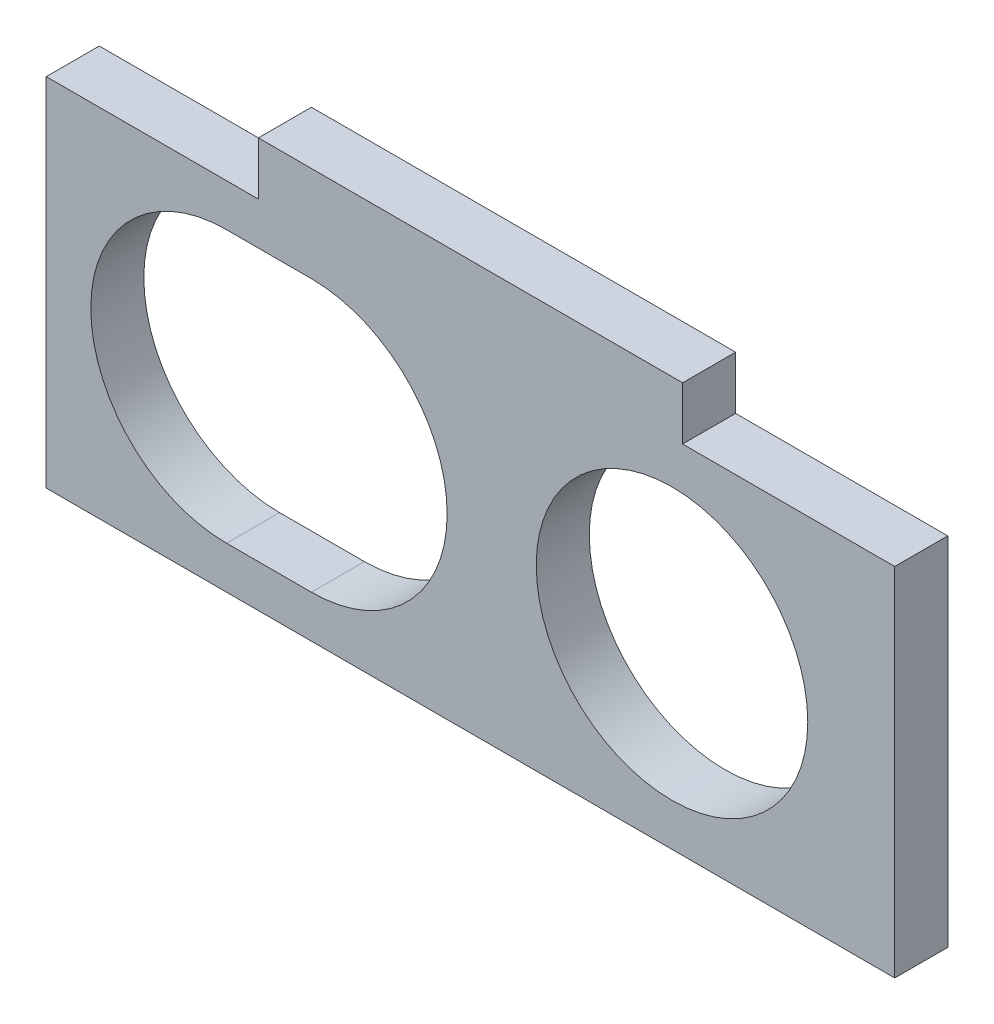
ISO-10303-21;
HEADER;
FILE_DESCRIPTION(('STEP AP214'),'2;1');
FILE_NAME('part.step','',(''),(''),'','','');
FILE_SCHEMA(('AUTOMOTIVE_DESIGN { 1 0 10303 214 1 1 1 1 }'));
ENDSEC;
DATA;
#1=APPLICATION_CONTEXT('core data for automotive mechanical design processes');
#2=APPLICATION_PROTOCOL_DEFINITION('international standard','automotive_design',2000,#1);
#3=PRODUCT_CONTEXT('',#1,'mechanical');
#4=PRODUCT('Part','Part','',(#3));
#5=PRODUCT_RELATED_PRODUCT_CATEGORY('part','',(#4));
#6=PRODUCT_DEFINITION_FORMATION('','',#4);
#7=PRODUCT_DEFINITION_CONTEXT('part definition',#1,'design');
#8=PRODUCT_DEFINITION('design','',#6,#7);
#9=PRODUCT_DEFINITION_SHAPE('','',#8);
#10=(LENGTH_UNIT() NAMED_UNIT(*) SI_UNIT(.MILLI.,.METRE.));
#11=(NAMED_UNIT(*) PLANE_ANGLE_UNIT() SI_UNIT($,.RADIAN.));
#12=(NAMED_UNIT(*) SI_UNIT($,.STERADIAN.) SOLID_ANGLE_UNIT());
#13=UNCERTAINTY_MEASURE_WITH_UNIT(LENGTH_MEASURE(1.E-05),#10,'distance_accuracy_value','');
#14=(GEOMETRIC_REPRESENTATION_CONTEXT(3) GLOBAL_UNCERTAINTY_ASSIGNED_CONTEXT((#13)) GLOBAL_UNIT_ASSIGNED_CONTEXT((#10,
#11,#12)) REPRESENTATION_CONTEXT('',''));
#15=CARTESIAN_POINT('',(0.,0.,0.));
#16=DIRECTION('',(0.,0.,1.));
#17=DIRECTION('',(1.,0.,0.));
#18=AXIS2_PLACEMENT_3D('',#15,#16,#17);
#19=CARTESIAN_POINT('',(25.4,-12.2555,3.175));
#20=DIRECTION('',(-1.,0.,0.));
#21=DIRECTION('',(0.,0.,1.));
#22=AXIS2_PLACEMENT_3D('',#19,#20,#21);
#23=PLANE('',#22);
#24=DIRECTION('',(0.,1.,0.));
#25=VECTOR('',#24,1.);
#26=CARTESIAN_POINT('',(25.4,-12.2555,0.));
#27=LINE('',#26,#25);
#28=CARTESIAN_POINT('',(25.4,-12.2555,0.));
#29=VERTEX_POINT('',#28);
#30=CARTESIAN_POINT('',(25.4,9.08050000000002,0.));
#31=VERTEX_POINT('',#30);
#32=EDGE_CURVE('E145',#29,#31,#27,.T.);
#33=ORIENTED_EDGE('',*,*,#32,.T.);
#34=DIRECTION('',(0.,0.,1.));
#35=VECTOR('',#34,1.);
#36=CARTESIAN_POINT('',(25.4,9.08050000000002,0.));
#37=LINE('',#36,#35);
#38=CARTESIAN_POINT('',(25.4,9.08050000000002,3.175));
#39=VERTEX_POINT('',#38);
#40=EDGE_CURVE('E181',#31,#39,#37,.T.);
#41=ORIENTED_EDGE('',*,*,#40,.T.);
#42=DIRECTION('',(0.,1.,0.));
#43=VECTOR('',#42,1.);
#44=CARTESIAN_POINT('',(25.4,-12.2555,3.175));
#45=LINE('',#44,#43);
#46=CARTESIAN_POINT('',(25.4,-12.2555,3.175));
#47=VERTEX_POINT('',#46);
#48=EDGE_CURVE('E154',#47,#39,#45,.T.);
#49=ORIENTED_EDGE('',*,*,#48,.F.);
#50=DIRECTION('',(0.,0.,-1.));
#51=VECTOR('',#50,1.);
#52=CARTESIAN_POINT('',(25.4,-12.2555,3.175));
#53=LINE('',#52,#51);
#54=EDGE_CURVE('E40',#47,#29,#53,.T.);
#55=ORIENTED_EDGE('',*,*,#54,.T.);
#56=EDGE_LOOP('',(#33,#41,#49,#55));
#57=FACE_BOUND('',#56,.T.);
#58=ADVANCED_FACE('F33',(#57),#23,.F.);
#59=CARTESIAN_POINT('',(-25.4,12.2555,3.175));
#60=DIRECTION('',(0.,-1.,0.));
#61=DIRECTION('',(0.,0.,-1.));
#62=AXIS2_PLACEMENT_3D('',#59,#60,#61);
#63=PLANE('',#62);
#64=DIRECTION('',(-1.,0.,0.));
#65=VECTOR('',#64,1.);
#66=CARTESIAN_POINT('',(-25.4,12.2555,3.175));
#67=LINE('',#66,#65);
#68=CARTESIAN_POINT('',(12.7,12.2555,3.175));
#69=VERTEX_POINT('',#68);
#70=CARTESIAN_POINT('',(-12.7,12.2555,3.175));
#71=VERTEX_POINT('',#70);
#72=EDGE_CURVE('E137',#69,#71,#67,.T.);
#73=ORIENTED_EDGE('',*,*,#72,.F.);
#74=DIRECTION('',(0.,0.,1.));
#75=VECTOR('',#74,1.);
#76=CARTESIAN_POINT('',(12.7,12.2555,0.));
#77=LINE('',#76,#75);
#78=CARTESIAN_POINT('',(12.7,12.2555,0.));
#79=VERTEX_POINT('',#78);
#80=EDGE_CURVE('E124',#79,#69,#77,.T.);
#81=ORIENTED_EDGE('',*,*,#80,.F.);
#82=DIRECTION('',(-1.,0.,0.));
#83=VECTOR('',#82,1.);
#84=CARTESIAN_POINT('',(-25.4,12.2555,0.));
#85=LINE('',#84,#83);
#86=CARTESIAN_POINT('',(-12.7,12.2555,0.));
#87=VERTEX_POINT('',#86);
#88=EDGE_CURVE('E135',#79,#87,#85,.T.);
#89=ORIENTED_EDGE('',*,*,#88,.T.);
#90=DIRECTION('',(0.,0.,1.));
#91=VECTOR('',#90,1.);
#92=CARTESIAN_POINT('',(-12.7,12.2555,0.));
#93=LINE('',#92,#91);
#94=EDGE_CURVE('E150',#87,#71,#93,.T.);
#95=ORIENTED_EDGE('',*,*,#94,.T.);
#96=EDGE_LOOP('',(#73,#81,#89,#95));
#97=FACE_BOUND('',#96,.T.);
#98=ADVANCED_FACE('F133',(#97),#63,.F.);
#99=CARTESIAN_POINT('',(-25.4,-12.2555,3.175));
#100=DIRECTION('',(1.,0.,0.));
#101=DIRECTION('',(0.,0.,-1.));
#102=AXIS2_PLACEMENT_3D('',#99,#100,#101);
#103=PLANE('',#102);
#104=DIRECTION('',(0.,-1.,0.));
#105=VECTOR('',#104,1.);
#106=CARTESIAN_POINT('',(-25.4,-12.2555,3.175));
#107=LINE('',#106,#105);
#108=CARTESIAN_POINT('',(-25.4,9.0805,3.175));
#109=VERTEX_POINT('',#108);
#110=CARTESIAN_POINT('',(-25.4,-12.2555,3.175));
#111=VERTEX_POINT('',#110);
#112=EDGE_CURVE('E161',#109,#111,#107,.T.);
#113=ORIENTED_EDGE('',*,*,#112,.F.);
#114=DIRECTION('',(0.,0.,1.));
#115=VECTOR('',#114,1.);
#116=CARTESIAN_POINT('',(-25.4,9.0805,0.));
#117=LINE('',#116,#115);
#118=CARTESIAN_POINT('',(-25.4,9.0805,0.));
#119=VERTEX_POINT('',#118);
#120=EDGE_CURVE('E169',#119,#109,#117,.T.);
#121=ORIENTED_EDGE('',*,*,#120,.F.);
#122=DIRECTION('',(0.,-1.,0.));
#123=VECTOR('',#122,1.);
#124=CARTESIAN_POINT('',(-25.4,-12.2555,0.));
#125=LINE('',#124,#123);
#126=CARTESIAN_POINT('',(-25.4,-12.2555,0.));
#127=VERTEX_POINT('',#126);
#128=EDGE_CURVE('E144',#119,#127,#125,.T.);
#129=ORIENTED_EDGE('',*,*,#128,.T.);
#130=DIRECTION('',(0.,0.,-1.));
#131=VECTOR('',#130,1.);
#132=CARTESIAN_POINT('',(-25.4,-12.2555,3.175));
#133=LINE('',#132,#131);
#134=EDGE_CURVE('E11',#111,#127,#133,.T.);
#135=ORIENTED_EDGE('',*,*,#134,.F.);
#136=EDGE_LOOP('',(#113,#121,#129,#135));
#137=FACE_BOUND('',#136,.T.);
#138=ADVANCED_FACE('F245',(#137),#103,.F.);
#139=CARTESIAN_POINT('',(-25.4,-12.2555,3.175));
#140=DIRECTION('',(0.,1.,0.));
#141=DIRECTION('',(0.,0.,1.));
#142=AXIS2_PLACEMENT_3D('',#139,#140,#141);
#143=PLANE('',#142);
#144=DIRECTION('',(1.,0.,0.));
#145=VECTOR('',#144,1.);
#146=CARTESIAN_POINT('',(-25.4,-12.2555,0.));
#147=LINE('',#146,#145);
#148=EDGE_CURVE('E147',#127,#29,#147,.T.);
#149=ORIENTED_EDGE('',*,*,#148,.T.);
#150=ORIENTED_EDGE('',*,*,#54,.F.);
#151=DIRECTION('',(1.,0.,0.));
#152=VECTOR('',#151,1.);
#153=CARTESIAN_POINT('',(-25.4,-12.2555,3.175));
#154=LINE('',#153,#152);
#155=EDGE_CURVE('E156',#111,#47,#154,.T.);
#156=ORIENTED_EDGE('',*,*,#155,.F.);
#157=ORIENTED_EDGE('',*,*,#134,.T.);
#158=EDGE_LOOP('',(#149,#150,#156,#157));
#159=FACE_BOUND('',#158,.T.);
#160=ADVANCED_FACE('F249',(#159),#143,.F.);
#161=CARTESIAN_POINT('',(0.,0.,3.175));
#162=DIRECTION('',(0.,0.,-1.));
#163=DIRECTION('',(-1.,0.,0.));
#164=AXIS2_PLACEMENT_3D('',#161,#162,#163);
#165=PLANE('',#164);
#166=DIRECTION('',(1.,0.,0.));
#167=VECTOR('',#166,1.);
#168=CARTESIAN_POINT('',(-14.605,-9.7155,3.175));
#169=LINE('',#168,#167);
#170=CARTESIAN_POINT('',(-14.605,-9.7155,3.175));
#171=VERTEX_POINT('',#170);
#172=CARTESIAN_POINT('',(-9.52499999999999,-9.7155,3.175));
#173=VERTEX_POINT('',#172);
#174=EDGE_CURVE('E207',#171,#173,#169,.T.);
#175=ORIENTED_EDGE('',*,*,#174,.F.);
#176=CARTESIAN_POINT('',(-14.605,-1.58749999999999,3.175));
#177=DIRECTION('',(0.,0.,1.));
#178=DIRECTION('',(1.,0.,0.));
#179=AXIS2_PLACEMENT_3D('',#176,#177,#178);
#180=CIRCLE('',#179,8.12800000000001);
#181=CARTESIAN_POINT('',(-14.605,6.54050000000001,3.175));
#182=VERTEX_POINT('',#181);
#183=EDGE_CURVE('E47',#182,#171,#180,.T.);
#184=ORIENTED_EDGE('',*,*,#183,.F.);
#185=DIRECTION('',(-1.,0.,0.));
#186=VECTOR('',#185,1.);
#187=CARTESIAN_POINT('',(-14.605,6.54050000000001,3.175));
#188=LINE('',#187,#186);
#189=CARTESIAN_POINT('',(-9.52499999999999,6.54050000000001,3.175));
#190=VERTEX_POINT('',#189);
#191=EDGE_CURVE('E200',#190,#182,#188,.T.);
#192=ORIENTED_EDGE('',*,*,#191,.F.);
#193=CARTESIAN_POINT('',(-9.52499999999999,-1.58749999999999,3.175));
#194=DIRECTION('',(0.,0.,1.));
#195=DIRECTION('',(-1.,0.,0.));
#196=AXIS2_PLACEMENT_3D('',#193,#194,#195);
#197=CIRCLE('',#196,8.12800000000001);
#198=EDGE_CURVE('E204',#173,#190,#197,.T.);
#199=ORIENTED_EDGE('',*,*,#198,.F.);
#200=EDGE_LOOP('',(#175,#184,#192,#199));
#201=FACE_BOUND('',#200,.T.);
#202=CARTESIAN_POINT('',(12.065,-1.58749999999999,3.175));
#203=DIRECTION('',(0.,0.,1.));
#204=DIRECTION('',(1.,0.,0.));
#205=AXIS2_PLACEMENT_3D('',#202,#203,#204);
#206=CIRCLE('',#205,8.12799999999999);
#207=CARTESIAN_POINT('',(20.193,-1.58749999999999,3.175));
#208=VERTEX_POINT('',#207);
#209=EDGE_CURVE('E184',#208,#208,#206,.T.);
#210=ORIENTED_EDGE('',*,*,#209,.F.);
#211=EDGE_LOOP('',(#210));
#212=FACE_BOUND('',#211,.T.);
#213=ORIENTED_EDGE('',*,*,#48,.T.);
#214=DIRECTION('',(1.,0.,0.));
#215=VECTOR('',#214,1.);
#216=CARTESIAN_POINT('',(25.4,9.08050000000002,3.175));
#217=LINE('',#216,#215);
#218=CARTESIAN_POINT('',(12.7,9.0805,3.175));
#219=VERTEX_POINT('',#218);
#220=EDGE_CURVE('E129',#219,#39,#217,.T.);
#221=ORIENTED_EDGE('',*,*,#220,.F.);
#222=DIRECTION('',(0.,-1.,0.));
#223=VECTOR('',#222,1.);
#224=CARTESIAN_POINT('',(12.7,12.2555,3.175));
#225=LINE('',#224,#223);
#226=EDGE_CURVE('E199',#69,#219,#225,.T.);
#227=ORIENTED_EDGE('',*,*,#226,.F.);
#228=ORIENTED_EDGE('',*,*,#72,.T.);
#229=DIRECTION('',(0.,1.,0.));
#230=VECTOR('',#229,1.);
#231=CARTESIAN_POINT('',(-12.7,12.2555,3.175));
#232=LINE('',#231,#230);
#233=CARTESIAN_POINT('',(-12.7,9.0805,3.175));
#234=VERTEX_POINT('',#233);
#235=EDGE_CURVE('E174',#234,#71,#232,.T.);
#236=ORIENTED_EDGE('',*,*,#235,.F.);
#237=DIRECTION('',(1.,0.,0.));
#238=VECTOR('',#237,1.);
#239=CARTESIAN_POINT('',(-25.4,9.0805,3.175));
#240=LINE('',#239,#238);
#241=EDGE_CURVE('E178',#109,#234,#240,.T.);
#242=ORIENTED_EDGE('',*,*,#241,.F.);
#243=ORIENTED_EDGE('',*,*,#112,.T.);
#244=ORIENTED_EDGE('',*,*,#155,.T.);
#245=EDGE_LOOP('',(#213,#221,#227,#228,#236,#242,#243,#244));
#246=FACE_BOUND('',#245,.T.);
#247=ADVANCED_FACE('F228',(#201,#212,#246),#165,.F.);
#248=CARTESIAN_POINT('',(0.,0.,0.));
#249=DIRECTION('',(0.,0.,-1.));
#250=DIRECTION('',(-1.,0.,0.));
#251=AXIS2_PLACEMENT_3D('',#248,#249,#250);
#252=PLANE('',#251);
#253=DIRECTION('',(1.,0.,0.));
#254=VECTOR('',#253,1.);
#255=CARTESIAN_POINT('',(25.4,9.08050000000002,0.));
#256=LINE('',#255,#254);
#257=CARTESIAN_POINT('',(12.7,9.0805,0.));
#258=VERTEX_POINT('',#257);
#259=EDGE_CURVE('E55',#258,#31,#256,.T.);
#260=ORIENTED_EDGE('',*,*,#259,.T.);
#261=ORIENTED_EDGE('',*,*,#32,.F.);
#262=ORIENTED_EDGE('',*,*,#148,.F.);
#263=ORIENTED_EDGE('',*,*,#128,.F.);
#264=DIRECTION('',(1.,0.,0.));
#265=VECTOR('',#264,1.);
#266=CARTESIAN_POINT('',(-25.4,9.0805,0.));
#267=LINE('',#266,#265);
#268=CARTESIAN_POINT('',(-12.7,9.0805,0.));
#269=VERTEX_POINT('',#268);
#270=EDGE_CURVE('E177',#119,#269,#267,.T.);
#271=ORIENTED_EDGE('',*,*,#270,.T.);
#272=DIRECTION('',(0.,1.,0.));
#273=VECTOR('',#272,1.);
#274=CARTESIAN_POINT('',(-12.7,12.2555,0.));
#275=LINE('',#274,#273);
#276=EDGE_CURVE('E143',#269,#87,#275,.T.);
#277=ORIENTED_EDGE('',*,*,#276,.T.);
#278=ORIENTED_EDGE('',*,*,#88,.F.);
#279=DIRECTION('',(0.,-1.,0.));
#280=VECTOR('',#279,1.);
#281=CARTESIAN_POINT('',(12.7,12.2555,0.));
#282=LINE('',#281,#280);
#283=EDGE_CURVE('E120',#79,#258,#282,.T.);
#284=ORIENTED_EDGE('',*,*,#283,.T.);
#285=EDGE_LOOP('',(#260,#261,#262,#263,#271,#277,#278,#284));
#286=FACE_BOUND('',#285,.T.);
#287=CARTESIAN_POINT('',(-14.605,-1.58749999999999,0.));
#288=DIRECTION('',(0.,0.,1.));
#289=DIRECTION('',(1.,0.,0.));
#290=AXIS2_PLACEMENT_3D('',#287,#288,#289);
#291=CIRCLE('',#290,8.12800000000001);
#292=CARTESIAN_POINT('',(-14.605,6.54050000000001,0.));
#293=VERTEX_POINT('',#292);
#294=CARTESIAN_POINT('',(-14.605,-9.7155,0.));
#295=VERTEX_POINT('',#294);
#296=EDGE_CURVE('E203',#293,#295,#291,.T.);
#297=ORIENTED_EDGE('',*,*,#296,.T.);
#298=DIRECTION('',(1.,0.,0.));
#299=VECTOR('',#298,1.);
#300=CARTESIAN_POINT('',(-14.605,-9.7155,0.));
#301=LINE('',#300,#299);
#302=CARTESIAN_POINT('',(-9.52499999999999,-9.7155,0.));
#303=VERTEX_POINT('',#302);
#304=EDGE_CURVE('E216',#295,#303,#301,.T.);
#305=ORIENTED_EDGE('',*,*,#304,.T.);
#306=CARTESIAN_POINT('',(-9.52499999999999,-1.58749999999999,0.));
#307=DIRECTION('',(0.,0.,1.));
#308=DIRECTION('',(-1.,0.,0.));
#309=AXIS2_PLACEMENT_3D('',#306,#307,#308);
#310=CIRCLE('',#309,8.12800000000001);
#311=CARTESIAN_POINT('',(-9.52499999999999,6.54050000000001,0.));
#312=VERTEX_POINT('',#311);
#313=EDGE_CURVE('E213',#303,#312,#310,.T.);
#314=ORIENTED_EDGE('',*,*,#313,.T.);
#315=DIRECTION('',(-1.,0.,0.));
#316=VECTOR('',#315,1.);
#317=CARTESIAN_POINT('',(-14.605,6.54050000000001,0.));
#318=LINE('',#317,#316);
#319=EDGE_CURVE('E193',#312,#293,#318,.T.);
#320=ORIENTED_EDGE('',*,*,#319,.T.);
#321=EDGE_LOOP('',(#297,#305,#314,#320));
#322=FACE_BOUND('',#321,.T.);
#323=CARTESIAN_POINT('',(12.065,-1.58749999999999,0.));
#324=DIRECTION('',(0.,0.,1.));
#325=DIRECTION('',(1.,0.,0.));
#326=AXIS2_PLACEMENT_3D('',#323,#324,#325);
#327=CIRCLE('',#326,8.12799999999999);
#328=CARTESIAN_POINT('',(20.193,-1.58749999999999,0.));
#329=VERTEX_POINT('',#328);
#330=EDGE_CURVE('E187',#329,#329,#327,.T.);
#331=ORIENTED_EDGE('',*,*,#330,.T.);
#332=EDGE_LOOP('',(#331));
#333=FACE_BOUND('',#332,.T.);
#334=ADVANCED_FACE('F140',(#286,#322,#333),#252,.T.);
#335=CARTESIAN_POINT('',(-12.7,12.2555,0.));
#336=DIRECTION('',(1.,0.,0.));
#337=DIRECTION('',(0.,0.,-1.));
#338=AXIS2_PLACEMENT_3D('',#335,#336,#337);
#339=PLANE('',#338);
#340=ORIENTED_EDGE('',*,*,#235,.T.);
#341=ORIENTED_EDGE('',*,*,#94,.F.);
#342=ORIENTED_EDGE('',*,*,#276,.F.);
#343=DIRECTION('',(0.,0.,1.));
#344=VECTOR('',#343,1.);
#345=CARTESIAN_POINT('',(-12.7,9.0805,0.));
#346=LINE('',#345,#344);
#347=EDGE_CURVE('E171',#269,#234,#346,.T.);
#348=ORIENTED_EDGE('',*,*,#347,.T.);
#349=EDGE_LOOP('',(#340,#341,#342,#348));
#350=FACE_BOUND('',#349,.T.);
#351=ADVANCED_FACE('F258',(#350),#339,.F.);
#352=CARTESIAN_POINT('',(-25.4,9.0805,0.));
#353=DIRECTION('',(0.,-1.,0.));
#354=DIRECTION('',(1.,0.,0.));
#355=AXIS2_PLACEMENT_3D('',#352,#353,#354);
#356=PLANE('',#355);
#357=ORIENTED_EDGE('',*,*,#241,.T.);
#358=ORIENTED_EDGE('',*,*,#347,.F.);
#359=ORIENTED_EDGE('',*,*,#270,.F.);
#360=ORIENTED_EDGE('',*,*,#120,.T.);
#361=EDGE_LOOP('',(#357,#358,#359,#360));
#362=FACE_BOUND('',#361,.T.);
#363=ADVANCED_FACE('F262',(#362),#356,.F.);
#364=CARTESIAN_POINT('',(12.065,-1.58749999999999,0.));
#365=DIRECTION('',(0.,0.,1.));
#366=DIRECTION('',(1.,0.,0.));
#367=AXIS2_PLACEMENT_3D('',#364,#365,#366);
#368=CYLINDRICAL_SURFACE('',#367,8.12799999999999);
#369=ORIENTED_EDGE('',*,*,#330,.F.);
#370=EDGE_LOOP('',(#369));
#371=FACE_BOUND('',#370,.T.);
#372=ORIENTED_EDGE('',*,*,#209,.T.);
#373=EDGE_LOOP('',(#372));
#374=FACE_BOUND('',#373,.T.);
#375=ADVANCED_FACE('F265',(#371,#374),#368,.F.);
#376=CARTESIAN_POINT('',(-14.605,-1.58749999999999,0.));
#377=DIRECTION('',(0.,0.,1.));
#378=DIRECTION('',(1.,0.,0.));
#379=AXIS2_PLACEMENT_3D('',#376,#377,#378);
#380=CYLINDRICAL_SURFACE('',#379,8.12800000000001);
#381=ORIENTED_EDGE('',*,*,#183,.T.);
#382=DIRECTION('',(0.,0.,1.));
#383=VECTOR('',#382,1.);
#384=CARTESIAN_POINT('',(-14.605,-9.7155,0.));
#385=LINE('',#384,#383);
#386=EDGE_CURVE('E190',#295,#171,#385,.T.);
#387=ORIENTED_EDGE('',*,*,#386,.F.);
#388=ORIENTED_EDGE('',*,*,#296,.F.);
#389=DIRECTION('',(0.,0.,1.));
#390=VECTOR('',#389,1.);
#391=CARTESIAN_POINT('',(-14.605,6.54050000000001,0.));
#392=LINE('',#391,#390);
#393=EDGE_CURVE('E197',#293,#182,#392,.T.);
#394=ORIENTED_EDGE('',*,*,#393,.T.);
#395=EDGE_LOOP('',(#381,#387,#388,#394));
#396=FACE_BOUND('',#395,.T.);
#397=ADVANCED_FACE('F272',(#396),#380,.F.);
#398=CARTESIAN_POINT('',(-14.605,6.54050000000001,0.));
#399=DIRECTION('',(0.,1.,0.));
#400=DIRECTION('',(-1.,0.,0.));
#401=AXIS2_PLACEMENT_3D('',#398,#399,#400);
#402=PLANE('',#401);
#403=ORIENTED_EDGE('',*,*,#191,.T.);
#404=ORIENTED_EDGE('',*,*,#393,.F.);
#405=ORIENTED_EDGE('',*,*,#319,.F.);
#406=DIRECTION('',(0.,0.,1.));
#407=VECTOR('',#406,1.);
#408=CARTESIAN_POINT('',(-9.52499999999999,6.54050000000001,0.));
#409=LINE('',#408,#407);
#410=EDGE_CURVE('E195',#312,#190,#409,.T.);
#411=ORIENTED_EDGE('',*,*,#410,.T.);
#412=EDGE_LOOP('',(#403,#404,#405,#411));
#413=FACE_BOUND('',#412,.T.);
#414=ADVANCED_FACE('F275',(#413),#402,.F.);
#415=CARTESIAN_POINT('',(-9.52499999999999,-1.58749999999999,0.));
#416=DIRECTION('',(0.,0.,1.));
#417=DIRECTION('',(1.,0.,0.));
#418=AXIS2_PLACEMENT_3D('',#415,#416,#417);
#419=CYLINDRICAL_SURFACE('',#418,8.12800000000001);
#420=ORIENTED_EDGE('',*,*,#198,.T.);
#421=ORIENTED_EDGE('',*,*,#410,.F.);
#422=ORIENTED_EDGE('',*,*,#313,.F.);
#423=DIRECTION('',(0.,0.,1.));
#424=VECTOR('',#423,1.);
#425=CARTESIAN_POINT('',(-9.52499999999999,-9.7155,0.));
#426=LINE('',#425,#424);
#427=EDGE_CURVE('E192',#303,#173,#426,.T.);
#428=ORIENTED_EDGE('',*,*,#427,.T.);
#429=EDGE_LOOP('',(#420,#421,#422,#428));
#430=FACE_BOUND('',#429,.T.);
#431=ADVANCED_FACE('F238',(#430),#419,.F.);
#432=CARTESIAN_POINT('',(-14.605,-9.7155,0.));
#433=DIRECTION('',(0.,-1.,0.));
#434=DIRECTION('',(1.,0.,0.));
#435=AXIS2_PLACEMENT_3D('',#432,#433,#434);
#436=PLANE('',#435);
#437=ORIENTED_EDGE('',*,*,#174,.T.);
#438=ORIENTED_EDGE('',*,*,#427,.F.);
#439=ORIENTED_EDGE('',*,*,#304,.F.);
#440=ORIENTED_EDGE('',*,*,#386,.T.);
#441=EDGE_LOOP('',(#437,#438,#439,#440));
#442=FACE_BOUND('',#441,.T.);
#443=ADVANCED_FACE('F231',(#442),#436,.F.);
#444=CARTESIAN_POINT('',(25.4,9.08050000000002,0.));
#445=DIRECTION('',(0.,-1.,0.));
#446=DIRECTION('',(1.,0.,0.));
#447=AXIS2_PLACEMENT_3D('',#444,#445,#446);
#448=PLANE('',#447);
#449=ORIENTED_EDGE('',*,*,#220,.T.);
#450=ORIENTED_EDGE('',*,*,#40,.F.);
#451=ORIENTED_EDGE('',*,*,#259,.F.);
#452=DIRECTION('',(0.,0.,1.));
#453=VECTOR('',#452,1.);
#454=CARTESIAN_POINT('',(12.7,9.0805,0.));
#455=LINE('',#454,#453);
#456=EDGE_CURVE('E126',#258,#219,#455,.T.);
#457=ORIENTED_EDGE('',*,*,#456,.T.);
#458=EDGE_LOOP('',(#449,#450,#451,#457));
#459=FACE_BOUND('',#458,.T.);
#460=ADVANCED_FACE('F229',(#459),#448,.F.);
#461=CARTESIAN_POINT('',(12.7,12.2555,0.));
#462=DIRECTION('',(-1.,0.,0.));
#463=DIRECTION('',(0.,0.,1.));
#464=AXIS2_PLACEMENT_3D('',#461,#462,#463);
#465=PLANE('',#464);
#466=ORIENTED_EDGE('',*,*,#226,.T.);
#467=ORIENTED_EDGE('',*,*,#456,.F.);
#468=ORIENTED_EDGE('',*,*,#283,.F.);
#469=ORIENTED_EDGE('',*,*,#80,.T.);
#470=EDGE_LOOP('',(#466,#467,#468,#469));
#471=FACE_BOUND('',#470,.T.);
#472=ADVANCED_FACE('F123',(#471),#465,.F.);
#473=CLOSED_SHELL('',(#58,#98,#138,#160,#247,#334,#351,#363,#375,#397,#414,#431,#443,#460,#472));
#474=MANIFOLD_SOLID_BREP('B2',#473);
#475=ADVANCED_BREP_SHAPE_REPRESENTATION('',(#18,#474),#14);
#476=SHAPE_DEFINITION_REPRESENTATION(#9,#475);
ENDSEC;
END-ISO-10303-21;
